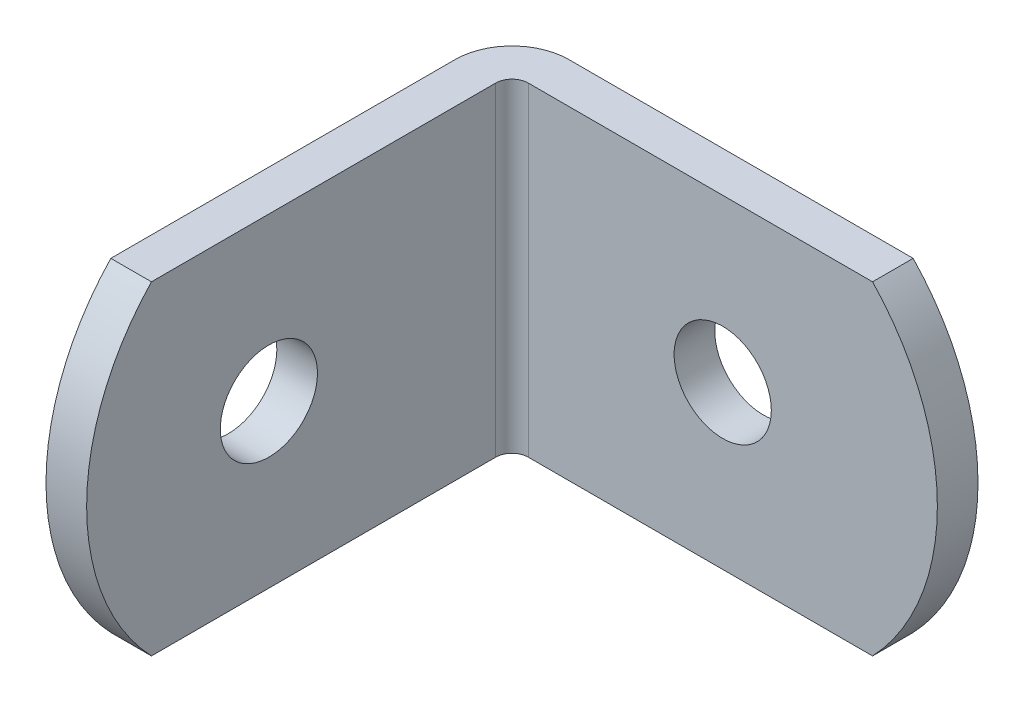
ISO-10303-21;
HEADER;
FILE_DESCRIPTION(('STEP AP214'),'2;1');
FILE_NAME('part.step','',(''),(''),'','','');
FILE_SCHEMA(('AUTOMOTIVE_DESIGN { 1 0 10303 214 1 1 1 1 }'));
ENDSEC;
DATA;
#1=APPLICATION_CONTEXT('core data for automotive mechanical design processes');
#2=APPLICATION_PROTOCOL_DEFINITION('international standard','automotive_design',2000,#1);
#3=PRODUCT_CONTEXT('',#1,'mechanical');
#4=PRODUCT('Part','Part','',(#3));
#5=PRODUCT_RELATED_PRODUCT_CATEGORY('part','',(#4));
#6=PRODUCT_DEFINITION_FORMATION('','',#4);
#7=PRODUCT_DEFINITION_CONTEXT('part definition',#1,'design');
#8=PRODUCT_DEFINITION('design','',#6,#7);
#9=PRODUCT_DEFINITION_SHAPE('','',#8);
#10=(LENGTH_UNIT() NAMED_UNIT(*) SI_UNIT(.MILLI.,.METRE.));
#11=(NAMED_UNIT(*) PLANE_ANGLE_UNIT() SI_UNIT($,.RADIAN.));
#12=(NAMED_UNIT(*) SI_UNIT($,.STERADIAN.) SOLID_ANGLE_UNIT());
#13=UNCERTAINTY_MEASURE_WITH_UNIT(LENGTH_MEASURE(1.E-05),#10,'distance_accuracy_value','');
#14=(GEOMETRIC_REPRESENTATION_CONTEXT(3) GLOBAL_UNCERTAINTY_ASSIGNED_CONTEXT((#13)) GLOBAL_UNIT_ASSIGNED_CONTEXT((#10,
#11,#12)) REPRESENTATION_CONTEXT('',''));
#15=CARTESIAN_POINT('',(0.,0.,0.));
#16=DIRECTION('',(0.,0.,1.));
#17=DIRECTION('',(1.,0.,0.));
#18=AXIS2_PLACEMENT_3D('',#15,#16,#17);
#19=CARTESIAN_POINT('',(73.5960459180228,0.,11.41095));
#20=DIRECTION('',(-1.,0.,0.));
#21=DIRECTION('',(0.,0.,1.));
#22=AXIS2_PLACEMENT_3D('',#19,#20,#21);
#23=CYLINDRICAL_SURFACE('',#22,11.60145);
#24=DIRECTION('',(-1.,0.,0.));
#25=VECTOR('',#24,1.);
#26=CARTESIAN_POINT('',(73.5960459180228,-8.001,19.812));
#27=LINE('',#26,#25);
#28=CARTESIAN_POINT('',(0.,-8.001,19.812));
#29=VERTEX_POINT('',#28);
#30=CARTESIAN_POINT('',(2.0066,-8.001,19.812));
#31=VERTEX_POINT('',#30);
#32=EDGE_CURVE('E50',#29,#31,#27,.F.);
#33=ORIENTED_EDGE('',*,*,#32,.T.);
#34=CARTESIAN_POINT('',(2.0066,0.,11.41095));
#35=DIRECTION('',(-1.,0.,0.));
#36=DIRECTION('',(0.,0.,1.));
#37=AXIS2_PLACEMENT_3D('',#34,#35,#36);
#38=CIRCLE('',#37,11.60145);
#39=CARTESIAN_POINT('',(2.0066,8.001,19.812));
#40=VERTEX_POINT('',#39);
#41=EDGE_CURVE('E143',#40,#31,#38,.F.);
#42=ORIENTED_EDGE('',*,*,#41,.F.);
#43=DIRECTION('',(-1.,0.,0.));
#44=VECTOR('',#43,1.);
#45=CARTESIAN_POINT('',(73.5960459180228,8.001,19.812));
#46=LINE('',#45,#44);
#47=CARTESIAN_POINT('',(0.,8.001,19.812));
#48=VERTEX_POINT('',#47);
#49=EDGE_CURVE('E138',#40,#48,#46,.T.);
#50=ORIENTED_EDGE('',*,*,#49,.T.);
#51=CARTESIAN_POINT('',(0.,0.,11.41095));
#52=DIRECTION('',(-1.,0.,0.));
#53=DIRECTION('',(0.,0.,1.));
#54=AXIS2_PLACEMENT_3D('',#51,#52,#53);
#55=CIRCLE('',#54,11.60145);
#56=EDGE_CURVE('E146',#48,#29,#55,.F.);
#57=ORIENTED_EDGE('',*,*,#56,.T.);
#58=EDGE_LOOP('',(#33,#42,#50,#57));
#59=FACE_BOUND('',#58,.T.);
#60=ADVANCED_FACE('F41',(#59),#23,.T.);
#61=CARTESIAN_POINT('',(2.80924,8.001,2.0066));
#62=DIRECTION('',(0.,0.,-1.));
#63=DIRECTION('',(-1.,0.,0.));
#64=AXIS2_PLACEMENT_3D('',#61,#62,#63);
#65=PLANE('',#64);
#66=CARTESIAN_POINT('',(12.4124,0.,2.0066));
#67=DIRECTION('',(0.,0.,1.));
#68=DIRECTION('',(1.,0.,0.));
#69=AXIS2_PLACEMENT_3D('',#66,#67,#68);
#70=CIRCLE('',#69,2.4);
#71=CARTESIAN_POINT('',(14.8124,0.,2.0066));
#72=VERTEX_POINT('',#71);
#73=EDGE_CURVE('E215',#72,#72,#70,.T.);
#74=ORIENTED_EDGE('',*,*,#73,.F.);
#75=EDGE_LOOP('',(#74));
#76=FACE_BOUND('',#75,.T.);
#77=DIRECTION('',(1.,0.,0.));
#78=VECTOR('',#77,1.);
#79=CARTESIAN_POINT('',(2.80924,-8.001,2.0066));
#80=LINE('',#79,#78);
#81=CARTESIAN_POINT('',(2.80924,-8.001,2.0066));
#82=VERTEX_POINT('',#81);
#83=CARTESIAN_POINT('',(19.812,-8.001,2.0066));
#84=VERTEX_POINT('',#83);
#85=EDGE_CURVE('E117',#82,#84,#80,.T.);
#86=ORIENTED_EDGE('',*,*,#85,.T.);
#87=CARTESIAN_POINT('',(11.41095,0.,2.0066));
#88=DIRECTION('',(0.,0.,-1.));
#89=DIRECTION('',(-1.,0.,0.));
#90=AXIS2_PLACEMENT_3D('',#87,#88,#89);
#91=CIRCLE('',#90,11.60145);
#92=CARTESIAN_POINT('',(19.812,8.001,2.0066));
#93=VERTEX_POINT('',#92);
#94=EDGE_CURVE('E64',#84,#93,#91,.F.);
#95=ORIENTED_EDGE('',*,*,#94,.T.);
#96=DIRECTION('',(1.,0.,0.));
#97=VECTOR('',#96,1.);
#98=CARTESIAN_POINT('',(2.80924,8.001,2.0066));
#99=LINE('',#98,#97);
#100=CARTESIAN_POINT('',(2.80924,8.001,2.0066));
#101=VERTEX_POINT('',#100);
#102=EDGE_CURVE('E150',#101,#93,#99,.T.);
#103=ORIENTED_EDGE('',*,*,#102,.F.);
#104=DIRECTION('',(0.,-1.,0.));
#105=VECTOR('',#104,1.);
#106=CARTESIAN_POINT('',(2.80924,8.001,2.0066));
#107=LINE('',#106,#105);
#108=EDGE_CURVE('E169',#101,#82,#107,.T.);
#109=ORIENTED_EDGE('',*,*,#108,.T.);
#110=EDGE_LOOP('',(#86,#95,#103,#109));
#111=FACE_BOUND('',#110,.T.);
#112=ADVANCED_FACE('F43',(#76,#111),#65,.F.);
#113=CARTESIAN_POINT('',(2.80924,8.001,0.));
#114=DIRECTION('',(0.,0.,-1.));
#115=DIRECTION('',(-1.,0.,0.));
#116=AXIS2_PLACEMENT_3D('',#113,#114,#115);
#117=PLANE('',#116);
#118=CARTESIAN_POINT('',(12.4124,0.,0.));
#119=DIRECTION('',(0.,0.,1.));
#120=DIRECTION('',(1.,0.,0.));
#121=AXIS2_PLACEMENT_3D('',#118,#119,#120);
#122=CIRCLE('',#121,2.4);
#123=CARTESIAN_POINT('',(14.8124,0.,0.));
#124=VERTEX_POINT('',#123);
#125=EDGE_CURVE('E212',#124,#124,#122,.T.);
#126=ORIENTED_EDGE('',*,*,#125,.T.);
#127=EDGE_LOOP('',(#126));
#128=FACE_BOUND('',#127,.T.);
#129=CARTESIAN_POINT('',(11.41095,0.,0.));
#130=DIRECTION('',(0.,0.,-1.));
#131=DIRECTION('',(-1.,0.,0.));
#132=AXIS2_PLACEMENT_3D('',#129,#130,#131);
#133=CIRCLE('',#132,11.60145);
#134=CARTESIAN_POINT('',(19.812,-8.001,0.));
#135=VERTEX_POINT('',#134);
#136=CARTESIAN_POINT('',(19.812,8.001,0.));
#137=VERTEX_POINT('',#136);
#138=EDGE_CURVE('E56',#135,#137,#133,.F.);
#139=ORIENTED_EDGE('',*,*,#138,.F.);
#140=DIRECTION('',(1.,0.,0.));
#141=VECTOR('',#140,1.);
#142=CARTESIAN_POINT('',(2.80924,-8.001,0.));
#143=LINE('',#142,#141);
#144=CARTESIAN_POINT('',(2.80924,-8.001,0.));
#145=VERTEX_POINT('',#144);
#146=EDGE_CURVE('E110',#145,#135,#143,.T.);
#147=ORIENTED_EDGE('',*,*,#146,.F.);
#148=DIRECTION('',(0.,-1.,0.));
#149=VECTOR('',#148,1.);
#150=CARTESIAN_POINT('',(2.80924,8.001,0.));
#151=LINE('',#150,#149);
#152=CARTESIAN_POINT('',(2.80924,8.001,0.));
#153=VERTEX_POINT('',#152);
#154=EDGE_CURVE('E193',#153,#145,#151,.T.);
#155=ORIENTED_EDGE('',*,*,#154,.F.);
#156=DIRECTION('',(1.,0.,0.));
#157=VECTOR('',#156,1.);
#158=CARTESIAN_POINT('',(2.80924,8.001,0.));
#159=LINE('',#158,#157);
#160=EDGE_CURVE('E122',#153,#137,#159,.T.);
#161=ORIENTED_EDGE('',*,*,#160,.T.);
#162=EDGE_LOOP('',(#139,#147,#155,#161));
#163=FACE_BOUND('',#162,.T.);
#164=ADVANCED_FACE('F120',(#128,#163),#117,.T.);
#165=CARTESIAN_POINT('',(2.80924,8.001,2.80924));
#166=DIRECTION('',(0.,-1.,0.));
#167=DIRECTION('',(0.,0.,-1.));
#168=AXIS2_PLACEMENT_3D('',#165,#166,#167);
#169=CYLINDRICAL_SURFACE('',#168,2.80924);
#170=CARTESIAN_POINT('',(2.80924,-8.001,2.80924));
#171=DIRECTION('',(0.,-1.,0.));
#172=DIRECTION('',(0.,0.,1.));
#173=AXIS2_PLACEMENT_3D('',#170,#171,#172);
#174=CIRCLE('',#173,2.80924);
#175=CARTESIAN_POINT('',(0.,-8.001,2.80924));
#176=VERTEX_POINT('',#175);
#177=EDGE_CURVE('E114',#176,#145,#174,.T.);
#178=ORIENTED_EDGE('',*,*,#177,.F.);
#179=DIRECTION('',(0.,-1.,0.));
#180=VECTOR('',#179,1.);
#181=CARTESIAN_POINT('',(0.,8.001,2.80924));
#182=LINE('',#181,#180);
#183=CARTESIAN_POINT('',(0.,8.001,2.80924));
#184=VERTEX_POINT('',#183);
#185=EDGE_CURVE('E189',#184,#176,#182,.T.);
#186=ORIENTED_EDGE('',*,*,#185,.F.);
#187=CARTESIAN_POINT('',(2.80924,8.001,2.80924));
#188=DIRECTION('',(0.,-1.,0.));
#189=DIRECTION('',(0.,0.,1.));
#190=AXIS2_PLACEMENT_3D('',#187,#188,#189);
#191=CIRCLE('',#190,2.80924);
#192=EDGE_CURVE('E156',#184,#153,#191,.T.);
#193=ORIENTED_EDGE('',*,*,#192,.T.);
#194=ORIENTED_EDGE('',*,*,#154,.T.);
#195=EDGE_LOOP('',(#178,#186,#193,#194));
#196=FACE_BOUND('',#195,.T.);
#197=ADVANCED_FACE('F208',(#196),#169,.T.);
#198=CARTESIAN_POINT('',(0.,8.001,2.80924));
#199=DIRECTION('',(-1.,0.,0.));
#200=DIRECTION('',(0.,0.,1.));
#201=AXIS2_PLACEMENT_3D('',#198,#199,#200);
#202=PLANE('',#201);
#203=CARTESIAN_POINT('',(0.,0.,14.0124));
#204=DIRECTION('',(1.,0.,0.));
#205=DIRECTION('',(0.,0.,-1.));
#206=AXIS2_PLACEMENT_3D('',#203,#204,#205);
#207=CIRCLE('',#206,2.4);
#208=CARTESIAN_POINT('',(0.,0.,11.6124));
#209=VERTEX_POINT('',#208);
#210=EDGE_CURVE('E132',#209,#209,#207,.T.);
#211=ORIENTED_EDGE('',*,*,#210,.T.);
#212=EDGE_LOOP('',(#211));
#213=FACE_BOUND('',#212,.T.);
#214=ORIENTED_EDGE('',*,*,#56,.F.);
#215=DIRECTION('',(0.,0.,-1.));
#216=VECTOR('',#215,1.);
#217=CARTESIAN_POINT('',(0.,8.001,2.80924));
#218=LINE('',#217,#216);
#219=EDGE_CURVE('E160',#48,#184,#218,.T.);
#220=ORIENTED_EDGE('',*,*,#219,.T.);
#221=ORIENTED_EDGE('',*,*,#185,.T.);
#222=DIRECTION('',(0.,0.,-1.));
#223=VECTOR('',#222,1.);
#224=CARTESIAN_POINT('',(0.,-8.001,2.80924));
#225=LINE('',#224,#223);
#226=EDGE_CURVE('E174',#29,#176,#225,.T.);
#227=ORIENTED_EDGE('',*,*,#226,.F.);
#228=EDGE_LOOP('',(#214,#220,#221,#227));
#229=FACE_BOUND('',#228,.T.);
#230=ADVANCED_FACE('F203',(#213,#229),#202,.T.);
#231=CARTESIAN_POINT('',(2.0066,8.001,2.80924));
#232=DIRECTION('',(-1.,0.,0.));
#233=DIRECTION('',(0.,0.,1.));
#234=AXIS2_PLACEMENT_3D('',#231,#232,#233);
#235=PLANE('',#234);
#236=CARTESIAN_POINT('',(2.0066,0.,14.0124));
#237=DIRECTION('',(1.,0.,0.));
#238=DIRECTION('',(0.,0.,-1.));
#239=AXIS2_PLACEMENT_3D('',#236,#237,#238);
#240=CIRCLE('',#239,2.4);
#241=CARTESIAN_POINT('',(2.0066,0.,11.6124));
#242=VERTEX_POINT('',#241);
#243=EDGE_CURVE('E128',#242,#242,#240,.T.);
#244=ORIENTED_EDGE('',*,*,#243,.F.);
#245=EDGE_LOOP('',(#244));
#246=FACE_BOUND('',#245,.T.);
#247=ORIENTED_EDGE('',*,*,#41,.T.);
#248=DIRECTION('',(0.,0.,-1.));
#249=VECTOR('',#248,1.);
#250=CARTESIAN_POINT('',(2.0066,-8.001,2.80924));
#251=LINE('',#250,#249);
#252=CARTESIAN_POINT('',(2.0066,-8.001,2.80924));
#253=VERTEX_POINT('',#252);
#254=EDGE_CURVE('E177',#31,#253,#251,.T.);
#255=ORIENTED_EDGE('',*,*,#254,.T.);
#256=DIRECTION('',(0.,-1.,0.));
#257=VECTOR('',#256,1.);
#258=CARTESIAN_POINT('',(2.0066,8.001,2.80924));
#259=LINE('',#258,#257);
#260=CARTESIAN_POINT('',(2.0066,8.001,2.80924));
#261=VERTEX_POINT('',#260);
#262=EDGE_CURVE('E185',#261,#253,#259,.T.);
#263=ORIENTED_EDGE('',*,*,#262,.F.);
#264=DIRECTION('',(0.,0.,-1.));
#265=VECTOR('',#264,1.);
#266=CARTESIAN_POINT('',(2.0066,8.001,2.80924));
#267=LINE('',#266,#265);
#268=EDGE_CURVE('E163',#40,#261,#267,.T.);
#269=ORIENTED_EDGE('',*,*,#268,.F.);
#270=EDGE_LOOP('',(#247,#255,#263,#269));
#271=FACE_BOUND('',#270,.T.);
#272=ADVANCED_FACE('F232',(#246,#271),#235,.F.);
#273=CARTESIAN_POINT('',(2.80924,8.001,2.80924));
#274=DIRECTION('',(0.,-1.,0.));
#275=DIRECTION('',(0.,0.,-1.));
#276=AXIS2_PLACEMENT_3D('',#273,#274,#275);
#277=CYLINDRICAL_SURFACE('',#276,0.80264);
#278=CARTESIAN_POINT('',(2.80924,-8.001,2.80924));
#279=DIRECTION('',(0.,1.,0.));
#280=DIRECTION('',(1.,0.,0.));
#281=AXIS2_PLACEMENT_3D('',#278,#279,#280);
#282=CIRCLE('',#281,0.80264);
#283=EDGE_CURVE('E153',#253,#82,#282,.F.);
#284=ORIENTED_EDGE('',*,*,#283,.T.);
#285=ORIENTED_EDGE('',*,*,#108,.F.);
#286=CARTESIAN_POINT('',(2.80924,8.001,2.80924));
#287=DIRECTION('',(0.,1.,0.));
#288=DIRECTION('',(1.,0.,0.));
#289=AXIS2_PLACEMENT_3D('',#286,#287,#288);
#290=CIRCLE('',#289,0.80264);
#291=EDGE_CURVE('E166',#261,#101,#290,.F.);
#292=ORIENTED_EDGE('',*,*,#291,.F.);
#293=ORIENTED_EDGE('',*,*,#262,.T.);
#294=EDGE_LOOP('',(#284,#285,#292,#293));
#295=FACE_BOUND('',#294,.T.);
#296=ADVANCED_FACE('F227',(#295),#277,.F.);
#297=CARTESIAN_POINT('',(2.80924,8.001,2.80924));
#298=DIRECTION('',(0.,-1.,0.));
#299=DIRECTION('',(-1.,0.,0.));
#300=AXIS2_PLACEMENT_3D('',#297,#298,#299);
#301=PLANE('',#300);
#302=ORIENTED_EDGE('',*,*,#102,.T.);
#303=DIRECTION('',(0.,0.,-1.));
#304=VECTOR('',#303,1.);
#305=CARTESIAN_POINT('',(19.812,8.001,69.5955459180228));
#306=LINE('',#305,#304);
#307=EDGE_CURVE('E124',#93,#137,#306,.T.);
#308=ORIENTED_EDGE('',*,*,#307,.T.);
#309=ORIENTED_EDGE('',*,*,#160,.F.);
#310=ORIENTED_EDGE('',*,*,#192,.F.);
#311=ORIENTED_EDGE('',*,*,#219,.F.);
#312=ORIENTED_EDGE('',*,*,#49,.F.);
#313=ORIENTED_EDGE('',*,*,#268,.T.);
#314=ORIENTED_EDGE('',*,*,#291,.T.);
#315=EDGE_LOOP('',(#302,#308,#309,#310,#311,#312,#313,#314));
#316=FACE_BOUND('',#315,.T.);
#317=ADVANCED_FACE('F210',(#316),#301,.F.);
#318=CARTESIAN_POINT('',(2.80924,-8.001,2.80924));
#319=DIRECTION('',(0.,-1.,0.));
#320=DIRECTION('',(-1.,0.,0.));
#321=AXIS2_PLACEMENT_3D('',#318,#319,#320);
#322=PLANE('',#321);
#323=DIRECTION('',(0.,0.,-1.));
#324=VECTOR('',#323,1.);
#325=CARTESIAN_POINT('',(19.812,-8.001,69.5955459180228));
#326=LINE('',#325,#324);
#327=EDGE_CURVE('E11',#84,#135,#326,.T.);
#328=ORIENTED_EDGE('',*,*,#327,.F.);
#329=ORIENTED_EDGE('',*,*,#85,.F.);
#330=ORIENTED_EDGE('',*,*,#283,.F.);
#331=ORIENTED_EDGE('',*,*,#254,.F.);
#332=ORIENTED_EDGE('',*,*,#32,.F.);
#333=ORIENTED_EDGE('',*,*,#226,.T.);
#334=ORIENTED_EDGE('',*,*,#177,.T.);
#335=ORIENTED_EDGE('',*,*,#146,.T.);
#336=EDGE_LOOP('',(#328,#329,#330,#331,#332,#333,#334,#335));
#337=FACE_BOUND('',#336,.T.);
#338=ADVANCED_FACE('F111',(#337),#322,.T.);
#339=CARTESIAN_POINT('',(0.,0.,14.0124));
#340=DIRECTION('',(1.,0.,0.));
#341=DIRECTION('',(0.,0.,-1.));
#342=AXIS2_PLACEMENT_3D('',#339,#340,#341);
#343=CYLINDRICAL_SURFACE('',#342,2.4);
#344=ORIENTED_EDGE('',*,*,#210,.F.);
#345=EDGE_LOOP('',(#344));
#346=FACE_BOUND('',#345,.T.);
#347=ORIENTED_EDGE('',*,*,#243,.T.);
#348=EDGE_LOOP('',(#347));
#349=FACE_BOUND('',#348,.T.);
#350=ADVANCED_FACE('F250',(#346,#349),#343,.F.);
#351=CARTESIAN_POINT('',(11.41095,0.,69.5955459180228));
#352=DIRECTION('',(0.,0.,-1.));
#353=DIRECTION('',(-1.,0.,0.));
#354=AXIS2_PLACEMENT_3D('',#351,#352,#353);
#355=CYLINDRICAL_SURFACE('',#354,11.60145);
#356=ORIENTED_EDGE('',*,*,#94,.F.);
#357=ORIENTED_EDGE('',*,*,#327,.T.);
#358=ORIENTED_EDGE('',*,*,#138,.T.);
#359=ORIENTED_EDGE('',*,*,#307,.F.);
#360=EDGE_LOOP('',(#356,#357,#358,#359));
#361=FACE_BOUND('',#360,.T.);
#362=ADVANCED_FACE('F126',(#361),#355,.T.);
#363=CARTESIAN_POINT('',(12.4124,0.,0.));
#364=DIRECTION('',(0.,0.,1.));
#365=DIRECTION('',(1.,0.,0.));
#366=AXIS2_PLACEMENT_3D('',#363,#364,#365);
#367=CYLINDRICAL_SURFACE('',#366,2.4);
#368=ORIENTED_EDGE('',*,*,#125,.F.);
#369=EDGE_LOOP('',(#368));
#370=FACE_BOUND('',#369,.T.);
#371=ORIENTED_EDGE('',*,*,#73,.T.);
#372=EDGE_LOOP('',(#371));
#373=FACE_BOUND('',#372,.T.);
#374=ADVANCED_FACE('F222',(#370,#373),#367,.F.);
#375=CLOSED_SHELL('',(#60,#112,#164,#197,#230,#272,#296,#317,#338,#350,#362,#374));
#376=MANIFOLD_SOLID_BREP('B2',#375);
#377=ADVANCED_BREP_SHAPE_REPRESENTATION('',(#18,#376),#14);
#378=SHAPE_DEFINITION_REPRESENTATION(#9,#377);
ENDSEC;
END-ISO-10303-21;
